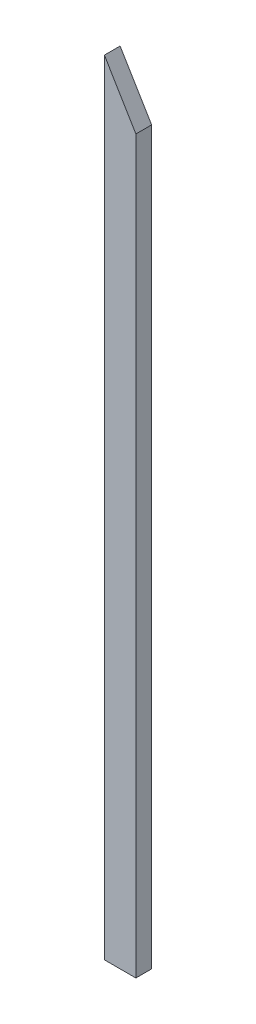
ISO-10303-21;
HEADER;
FILE_DESCRIPTION(('STEP AP214'),'2;1');
FILE_NAME('part.step','',(''),(''),'','','');
FILE_SCHEMA(('AUTOMOTIVE_DESIGN { 1 0 10303 214 1 1 1 1 }'));
ENDSEC;
DATA;
#1=APPLICATION_CONTEXT('core data for automotive mechanical design processes');
#2=APPLICATION_PROTOCOL_DEFINITION('international standard','automotive_design',2000,#1);
#3=PRODUCT_CONTEXT('',#1,'mechanical');
#4=PRODUCT('Part','Part','',(#3));
#5=PRODUCT_RELATED_PRODUCT_CATEGORY('part','',(#4));
#6=PRODUCT_DEFINITION_FORMATION('','',#4);
#7=PRODUCT_DEFINITION_CONTEXT('part definition',#1,'design');
#8=PRODUCT_DEFINITION('design','',#6,#7);
#9=PRODUCT_DEFINITION_SHAPE('','',#8);
#10=(LENGTH_UNIT() NAMED_UNIT(*) SI_UNIT(.MILLI.,.METRE.));
#11=(NAMED_UNIT(*) PLANE_ANGLE_UNIT() SI_UNIT($,.RADIAN.));
#12=(NAMED_UNIT(*) SI_UNIT($,.STERADIAN.) SOLID_ANGLE_UNIT());
#13=UNCERTAINTY_MEASURE_WITH_UNIT(LENGTH_MEASURE(1.E-05),#10,'distance_accuracy_value','');
#14=(GEOMETRIC_REPRESENTATION_CONTEXT(3) GLOBAL_UNCERTAINTY_ASSIGNED_CONTEXT((#13)) GLOBAL_UNIT_ASSIGNED_CONTEXT((#10,
#11,#12)) REPRESENTATION_CONTEXT('',''));
#15=CARTESIAN_POINT('',(0.,0.,0.));
#16=DIRECTION('',(0.,0.,1.));
#17=DIRECTION('',(1.,0.,0.));
#18=AXIS2_PLACEMENT_3D('',#15,#16,#17);
#19=CARTESIAN_POINT('',(-65.2206912499999,377.771796071428,19.05));
#20=DIRECTION('',(1.,0.,0.));
#21=DIRECTION('',(0.,0.,-1.));
#22=AXIS2_PLACEMENT_3D('',#19,#20,#21);
#23=PLANE('',#22);
#24=DIRECTION('',(0.,-1.,0.));
#25=VECTOR('',#24,1.);
#26=CARTESIAN_POINT('',(-65.2206912499999,377.771796071428,0.));
#27=LINE('',#26,#25);
#28=CARTESIAN_POINT('',(-65.2206912499999,377.771796071428,0.));
#29=VERTEX_POINT('',#28);
#30=CARTESIAN_POINT('',(-65.2206912499999,-570.892803928571,0.));
#31=VERTEX_POINT('',#30);
#32=EDGE_CURVE('E85',#29,#31,#27,.T.);
#33=ORIENTED_EDGE('',*,*,#32,.T.);
#34=DIRECTION('',(0.,0.,-1.));
#35=VECTOR('',#34,1.);
#36=CARTESIAN_POINT('',(-65.2206912499999,-570.892803928571,19.05));
#37=LINE('',#36,#35);
#38=CARTESIAN_POINT('',(-65.2206912499999,-570.892803928571,19.05));
#39=VERTEX_POINT('',#38);
#40=EDGE_CURVE('E11',#39,#31,#37,.T.);
#41=ORIENTED_EDGE('',*,*,#40,.F.);
#42=DIRECTION('',(0.,-1.,0.));
#43=VECTOR('',#42,1.);
#44=CARTESIAN_POINT('',(-65.2206912499999,377.771796071428,19.05));
#45=LINE('',#44,#43);
#46=CARTESIAN_POINT('',(-65.2206912499999,377.771796071428,19.05));
#47=VERTEX_POINT('',#46);
#48=EDGE_CURVE('E96',#47,#39,#45,.T.);
#49=ORIENTED_EDGE('',*,*,#48,.F.);
#50=DIRECTION('',(0.,0.,-1.));
#51=VECTOR('',#50,1.);
#52=CARTESIAN_POINT('',(-65.2206912499999,377.771796071428,19.05));
#53=LINE('',#52,#51);
#54=EDGE_CURVE('E92',#47,#29,#53,.T.);
#55=ORIENTED_EDGE('',*,*,#54,.T.);
#56=EDGE_LOOP('',(#33,#41,#49,#55));
#57=FACE_BOUND('',#56,.T.);
#58=ADVANCED_FACE('F39',(#57),#23,.F.);
#59=CARTESIAN_POINT('',(-65.2206912499999,-570.892803928571,19.05));
#60=DIRECTION('',(0.,1.,0.));
#61=DIRECTION('',(-1.,0.,0.));
#62=AXIS2_PLACEMENT_3D('',#59,#60,#61);
#63=PLANE('',#62);
#64=DIRECTION('',(1.,0.,0.));
#65=VECTOR('',#64,1.);
#66=CARTESIAN_POINT('',(-65.2206912499999,-570.892803928571,0.));
#67=LINE('',#66,#65);
#68=CARTESIAN_POINT('',(-27.1206912499998,-570.892803928571,0.));
#69=VERTEX_POINT('',#68);
#70=EDGE_CURVE('E74',#31,#69,#67,.T.);
#71=ORIENTED_EDGE('',*,*,#70,.T.);
#72=DIRECTION('',(0.,0.,-1.));
#73=VECTOR('',#72,1.);
#74=CARTESIAN_POINT('',(-27.1206912499998,-570.892803928571,19.05));
#75=LINE('',#74,#73);
#76=CARTESIAN_POINT('',(-27.1206912499998,-570.892803928571,19.05));
#77=VERTEX_POINT('',#76);
#78=EDGE_CURVE('E47',#77,#69,#75,.T.);
#79=ORIENTED_EDGE('',*,*,#78,.F.);
#80=DIRECTION('',(1.,0.,0.));
#81=VECTOR('',#80,1.);
#82=CARTESIAN_POINT('',(-65.2206912499999,-570.892803928571,19.05));
#83=LINE('',#82,#81);
#84=EDGE_CURVE('E63',#39,#77,#83,.T.);
#85=ORIENTED_EDGE('',*,*,#84,.F.);
#86=ORIENTED_EDGE('',*,*,#40,.T.);
#87=EDGE_LOOP('',(#71,#79,#85,#86));
#88=FACE_BOUND('',#87,.T.);
#89=ADVANCED_FACE('F76',(#88),#63,.F.);
#90=CARTESIAN_POINT('',(-27.1206912499999,377.771796071428,19.05));
#91=DIRECTION('',(-1.,0.,0.));
#92=DIRECTION('',(0.,-1.,0.));
#93=AXIS2_PLACEMENT_3D('',#90,#91,#92);
#94=PLANE('',#93);
#95=DIRECTION('',(0.,1.,0.));
#96=VECTOR('',#95,1.);
#97=CARTESIAN_POINT('',(-27.1206912499999,377.771796071428,0.));
#98=LINE('',#97,#96);
#99=CARTESIAN_POINT('',(-27.12069125,314.111334955507,0.));
#100=VERTEX_POINT('',#99);
#101=EDGE_CURVE('E84',#69,#100,#98,.T.);
#102=ORIENTED_EDGE('',*,*,#101,.T.);
#103=DIRECTION('',(0.,0.,1.));
#104=VECTOR('',#103,1.);
#105=CARTESIAN_POINT('',(-27.1206912499998,314.111334955507,0.));
#106=LINE('',#105,#104);
#107=CARTESIAN_POINT('',(-27.1206912499998,314.111334955507,19.05));
#108=VERTEX_POINT('',#107);
#109=EDGE_CURVE('E54',#100,#108,#106,.T.);
#110=ORIENTED_EDGE('',*,*,#109,.T.);
#111=DIRECTION('',(0.,1.,0.));
#112=VECTOR('',#111,1.);
#113=CARTESIAN_POINT('',(-27.1206912499999,377.771796071428,19.05));
#114=LINE('',#113,#112);
#115=EDGE_CURVE('E90',#77,#108,#114,.T.);
#116=ORIENTED_EDGE('',*,*,#115,.F.);
#117=ORIENTED_EDGE('',*,*,#78,.T.);
#118=EDGE_LOOP('',(#102,#110,#116,#117));
#119=FACE_BOUND('',#118,.T.);
#120=ADVANCED_FACE('F89',(#119),#94,.F.);
#121=CARTESIAN_POINT('',(0.,0.,19.05));
#122=DIRECTION('',(0.,0.,1.));
#123=DIRECTION('',(1.,0.,0.));
#124=AXIS2_PLACEMENT_3D('',#121,#122,#123);
#125=PLANE('',#124);
#126=DIRECTION('',(0.513541252058171,-0.858064905723644,0.));
#127=VECTOR('',#126,1.);
#128=CARTESIAN_POINT('',(-65.2206912499999,377.771796071428,19.05));
#129=LINE('',#128,#127);
#130=EDGE_CURVE('E117',#47,#108,#129,.T.);
#131=ORIENTED_EDGE('',*,*,#130,.F.);
#132=ORIENTED_EDGE('',*,*,#48,.T.);
#133=ORIENTED_EDGE('',*,*,#84,.T.);
#134=ORIENTED_EDGE('',*,*,#115,.T.);
#135=EDGE_LOOP('',(#131,#132,#133,#134));
#136=FACE_BOUND('',#135,.T.);
#137=ADVANCED_FACE('F123',(#136),#125,.T.);
#138=CARTESIAN_POINT('',(0.,0.,0.));
#139=DIRECTION('',(0.,0.,1.));
#140=DIRECTION('',(1.,0.,0.));
#141=AXIS2_PLACEMENT_3D('',#138,#139,#140);
#142=PLANE('',#141);
#143=ORIENTED_EDGE('',*,*,#32,.F.);
#144=DIRECTION('',(0.513541252058171,-0.858064905723644,0.));
#145=VECTOR('',#144,1.);
#146=CARTESIAN_POINT('',(-65.2206912499999,377.771796071428,0.));
#147=LINE('',#146,#145);
#148=EDGE_CURVE('E94',#29,#100,#147,.T.);
#149=ORIENTED_EDGE('',*,*,#148,.T.);
#150=ORIENTED_EDGE('',*,*,#101,.F.);
#151=ORIENTED_EDGE('',*,*,#70,.F.);
#152=EDGE_LOOP('',(#143,#149,#150,#151));
#153=FACE_BOUND('',#152,.T.);
#154=ADVANCED_FACE('F93',(#153),#142,.F.);
#155=CARTESIAN_POINT('',(-65.2206912499999,377.771796071428,0.));
#156=DIRECTION('',(-0.858064905723644,-0.513541252058171,0.));
#157=DIRECTION('',(0.513541252058171,-0.858064905723644,0.));
#158=AXIS2_PLACEMENT_3D('',#155,#156,#157);
#159=PLANE('',#158);
#160=ORIENTED_EDGE('',*,*,#130,.T.);
#161=ORIENTED_EDGE('',*,*,#109,.F.);
#162=ORIENTED_EDGE('',*,*,#148,.F.);
#163=ORIENTED_EDGE('',*,*,#54,.F.);
#164=EDGE_LOOP('',(#160,#161,#162,#163));
#165=FACE_BOUND('',#164,.T.);
#166=ADVANCED_FACE('F121',(#165),#159,.F.);
#167=CLOSED_SHELL('',(#58,#89,#120,#137,#154,#166));
#168=MANIFOLD_SOLID_BREP('B2',#167);
#169=ADVANCED_BREP_SHAPE_REPRESENTATION('',(#18,#168),#14);
#170=SHAPE_DEFINITION_REPRESENTATION(#9,#169);
ENDSEC;
END-ISO-10303-21;
